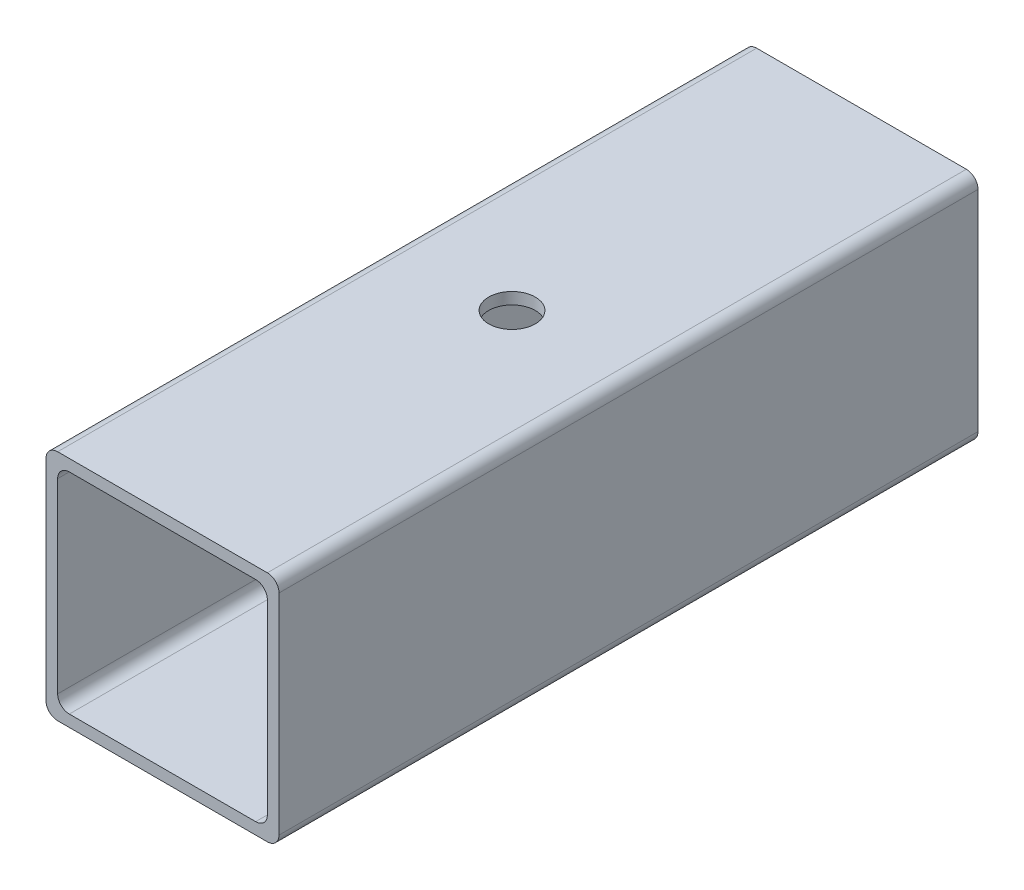
ISO-10303-21;
HEADER;
FILE_DESCRIPTION(('STEP AP214'),'2;1');
FILE_NAME('part.step','',(''),(''),'','','');
FILE_SCHEMA(('AUTOMOTIVE_DESIGN { 1 0 10303 214 1 1 1 1 }'));
ENDSEC;
DATA;
#1=APPLICATION_CONTEXT('core data for automotive mechanical design processes');
#2=APPLICATION_PROTOCOL_DEFINITION('international standard','automotive_design',2000,#1);
#3=PRODUCT_CONTEXT('',#1,'mechanical');
#4=PRODUCT('Part','Part','',(#3));
#5=PRODUCT_RELATED_PRODUCT_CATEGORY('part','',(#4));
#6=PRODUCT_DEFINITION_FORMATION('','',#4);
#7=PRODUCT_DEFINITION_CONTEXT('part definition',#1,'design');
#8=PRODUCT_DEFINITION('design','',#6,#7);
#9=PRODUCT_DEFINITION_SHAPE('','',#8);
#10=(LENGTH_UNIT() NAMED_UNIT(*) SI_UNIT(.MILLI.,.METRE.));
#11=(NAMED_UNIT(*) PLANE_ANGLE_UNIT() SI_UNIT($,.RADIAN.));
#12=(NAMED_UNIT(*) SI_UNIT($,.STERADIAN.) SOLID_ANGLE_UNIT());
#13=UNCERTAINTY_MEASURE_WITH_UNIT(LENGTH_MEASURE(1.E-05),#10,'distance_accuracy_value','');
#14=(GEOMETRIC_REPRESENTATION_CONTEXT(3) GLOBAL_UNCERTAINTY_ASSIGNED_CONTEXT((#13)) GLOBAL_UNIT_ASSIGNED_CONTEXT((#10,
#11,#12)) REPRESENTATION_CONTEXT('',''));
#15=CARTESIAN_POINT('',(0.,0.,0.));
#16=DIRECTION('',(0.,0.,1.));
#17=DIRECTION('',(1.,0.,0.));
#18=AXIS2_PLACEMENT_3D('',#15,#16,#17);
#19=CARTESIAN_POINT('',(0.,0.,180.));
#20=DIRECTION('',(0.,0.,1.));
#21=DIRECTION('',(1.,0.,0.));
#22=AXIS2_PLACEMENT_3D('',#19,#20,#21);
#23=PLANE('',#22);
#24=DIRECTION('',(1.,0.,0.));
#25=VECTOR('',#24,1.);
#26=CARTESIAN_POINT('',(-30.,-30.,180.));
#27=LINE('',#26,#25);
#28=CARTESIAN_POINT('',(-27.,-30.,180.));
#29=VERTEX_POINT('',#28);
#30=CARTESIAN_POINT('',(27.,-30.,180.));
#31=VERTEX_POINT('',#30);
#32=EDGE_CURVE('E180',#29,#31,#27,.T.);
#33=ORIENTED_EDGE('',*,*,#32,.T.);
#34=CARTESIAN_POINT('',(27.,-27.,180.));
#35=DIRECTION('',(0.,0.,1.));
#36=DIRECTION('',(1.,0.,0.));
#37=AXIS2_PLACEMENT_3D('',#34,#35,#36);
#38=CIRCLE('',#37,3.);
#39=CARTESIAN_POINT('',(30.,-27.,180.));
#40=VERTEX_POINT('',#39);
#41=EDGE_CURVE('E247',#31,#40,#38,.T.);
#42=ORIENTED_EDGE('',*,*,#41,.T.);
#43=DIRECTION('',(0.,1.,0.));
#44=VECTOR('',#43,1.);
#45=CARTESIAN_POINT('',(30.,30.,180.));
#46=LINE('',#45,#44);
#47=CARTESIAN_POINT('',(30.,27.,180.));
#48=VERTEX_POINT('',#47);
#49=EDGE_CURVE('E313',#40,#48,#46,.T.);
#50=ORIENTED_EDGE('',*,*,#49,.T.);
#51=CARTESIAN_POINT('',(27.,27.,180.));
#52=DIRECTION('',(0.,0.,1.));
#53=DIRECTION('',(1.,0.,0.));
#54=AXIS2_PLACEMENT_3D('',#51,#52,#53);
#55=CIRCLE('',#54,3.);
#56=CARTESIAN_POINT('',(27.,30.,180.));
#57=VERTEX_POINT('',#56);
#58=EDGE_CURVE('E239',#48,#57,#55,.T.);
#59=ORIENTED_EDGE('',*,*,#58,.T.);
#60=DIRECTION('',(-1.,0.,0.));
#61=VECTOR('',#60,1.);
#62=CARTESIAN_POINT('',(-30.,30.,180.));
#63=LINE('',#62,#61);
#64=CARTESIAN_POINT('',(-27.,30.,180.));
#65=VERTEX_POINT('',#64);
#66=EDGE_CURVE('E317',#57,#65,#63,.T.);
#67=ORIENTED_EDGE('',*,*,#66,.T.);
#68=CARTESIAN_POINT('',(-27.,27.,180.));
#69=DIRECTION('',(0.,0.,1.));
#70=DIRECTION('',(1.,0.,0.));
#71=AXIS2_PLACEMENT_3D('',#68,#69,#70);
#72=CIRCLE('',#71,3.);
#73=CARTESIAN_POINT('',(-30.,27.,180.));
#74=VERTEX_POINT('',#73);
#75=EDGE_CURVE('E61',#65,#74,#72,.T.);
#76=ORIENTED_EDGE('',*,*,#75,.T.);
#77=DIRECTION('',(0.,-1.,0.));
#78=VECTOR('',#77,1.);
#79=CARTESIAN_POINT('',(-30.,30.,180.));
#80=LINE('',#79,#78);
#81=CARTESIAN_POINT('',(-30.,-27.,180.));
#82=VERTEX_POINT('',#81);
#83=EDGE_CURVE('E188',#74,#82,#80,.T.);
#84=ORIENTED_EDGE('',*,*,#83,.T.);
#85=CARTESIAN_POINT('',(-27.,-27.,180.));
#86=DIRECTION('',(0.,0.,1.));
#87=DIRECTION('',(1.,0.,0.));
#88=AXIS2_PLACEMENT_3D('',#85,#86,#87);
#89=CIRCLE('',#88,3.);
#90=EDGE_CURVE('E244',#82,#29,#89,.T.);
#91=ORIENTED_EDGE('',*,*,#90,.T.);
#92=EDGE_LOOP('',(#33,#42,#50,#59,#67,#76,#84,#91));
#93=FACE_BOUND('',#92,.T.);
#94=DIRECTION('',(-1.,0.,0.));
#95=VECTOR('',#94,1.);
#96=CARTESIAN_POINT('',(-27.,27.,180.));
#97=LINE('',#96,#95);
#98=CARTESIAN_POINT('',(24.,27.,180.));
#99=VERTEX_POINT('',#98);
#100=CARTESIAN_POINT('',(-24.,27.,180.));
#101=VERTEX_POINT('',#100);
#102=EDGE_CURVE('E288',#99,#101,#97,.T.);
#103=ORIENTED_EDGE('',*,*,#102,.F.);
#104=CARTESIAN_POINT('',(24.,24.,180.));
#105=DIRECTION('',(0.,0.,1.));
#106=DIRECTION('',(1.,0.,0.));
#107=AXIS2_PLACEMENT_3D('',#104,#105,#106);
#108=CIRCLE('',#107,3.);
#109=CARTESIAN_POINT('',(27.,24.,180.));
#110=VERTEX_POINT('',#109);
#111=EDGE_CURVE('E164',#99,#110,#108,.F.);
#112=ORIENTED_EDGE('',*,*,#111,.T.);
#113=DIRECTION('',(0.,1.,0.));
#114=VECTOR('',#113,1.);
#115=CARTESIAN_POINT('',(27.,27.,180.));
#116=LINE('',#115,#114);
#117=CARTESIAN_POINT('',(27.,-24.,180.));
#118=VERTEX_POINT('',#117);
#119=EDGE_CURVE('E285',#118,#110,#116,.T.);
#120=ORIENTED_EDGE('',*,*,#119,.F.);
#121=CARTESIAN_POINT('',(24.,-24.,180.));
#122=DIRECTION('',(0.,0.,1.));
#123=DIRECTION('',(1.,0.,0.));
#124=AXIS2_PLACEMENT_3D('',#121,#122,#123);
#125=CIRCLE('',#124,3.);
#126=CARTESIAN_POINT('',(24.,-27.,180.));
#127=VERTEX_POINT('',#126);
#128=EDGE_CURVE('E272',#118,#127,#125,.F.);
#129=ORIENTED_EDGE('',*,*,#128,.T.);
#130=DIRECTION('',(1.,0.,0.));
#131=VECTOR('',#130,1.);
#132=CARTESIAN_POINT('',(-27.,-27.,180.));
#133=LINE('',#132,#131);
#134=CARTESIAN_POINT('',(-24.,-27.,180.));
#135=VERTEX_POINT('',#134);
#136=EDGE_CURVE('E327',#135,#127,#133,.T.);
#137=ORIENTED_EDGE('',*,*,#136,.F.);
#138=CARTESIAN_POINT('',(-24.,-24.,180.));
#139=DIRECTION('',(0.,0.,1.));
#140=DIRECTION('',(1.,0.,0.));
#141=AXIS2_PLACEMENT_3D('',#138,#139,#140);
#142=CIRCLE('',#141,3.);
#143=CARTESIAN_POINT('',(-27.,-24.,180.));
#144=VERTEX_POINT('',#143);
#145=EDGE_CURVE('E266',#135,#144,#142,.F.);
#146=ORIENTED_EDGE('',*,*,#145,.T.);
#147=DIRECTION('',(0.,-1.,0.));
#148=VECTOR('',#147,1.);
#149=CARTESIAN_POINT('',(-27.,27.,180.));
#150=LINE('',#149,#148);
#151=CARTESIAN_POINT('',(-27.,24.,180.));
#152=VERTEX_POINT('',#151);
#153=EDGE_CURVE('E478',#152,#144,#150,.T.);
#154=ORIENTED_EDGE('',*,*,#153,.F.);
#155=CARTESIAN_POINT('',(-24.,24.,180.));
#156=DIRECTION('',(0.,0.,1.));
#157=DIRECTION('',(1.,0.,0.));
#158=AXIS2_PLACEMENT_3D('',#155,#156,#157);
#159=CIRCLE('',#158,3.);
#160=EDGE_CURVE('E11',#152,#101,#159,.F.);
#161=ORIENTED_EDGE('',*,*,#160,.T.);
#162=EDGE_LOOP('',(#103,#112,#120,#129,#137,#146,#154,#161));
#163=FACE_BOUND('',#162,.T.);
#164=ADVANCED_FACE('F37',(#93,#163),#23,.T.);
#165=CARTESIAN_POINT('',(0.,0.,0.));
#166=DIRECTION('',(0.,0.,1.));
#167=DIRECTION('',(1.,0.,0.));
#168=AXIS2_PLACEMENT_3D('',#165,#166,#167);
#169=PLANE('',#168);
#170=DIRECTION('',(0.,1.,0.));
#171=VECTOR('',#170,1.);
#172=CARTESIAN_POINT('',(30.,30.,0.));
#173=LINE('',#172,#171);
#174=CARTESIAN_POINT('',(30.,-27.,0.));
#175=VERTEX_POINT('',#174);
#176=CARTESIAN_POINT('',(30.,27.,0.));
#177=VERTEX_POINT('',#176);
#178=EDGE_CURVE('E322',#175,#177,#173,.T.);
#179=ORIENTED_EDGE('',*,*,#178,.F.);
#180=CARTESIAN_POINT('',(27.,-27.,0.));
#181=DIRECTION('',(0.,0.,1.));
#182=DIRECTION('',(1.,0.,0.));
#183=AXIS2_PLACEMENT_3D('',#180,#181,#182);
#184=CIRCLE('',#183,3.);
#185=CARTESIAN_POINT('',(27.,-30.,0.));
#186=VERTEX_POINT('',#185);
#187=EDGE_CURVE('E229',#175,#186,#184,.F.);
#188=ORIENTED_EDGE('',*,*,#187,.T.);
#189=DIRECTION('',(1.,0.,0.));
#190=VECTOR('',#189,1.);
#191=CARTESIAN_POINT('',(-30.,-30.,0.));
#192=LINE('',#191,#190);
#193=CARTESIAN_POINT('',(-27.,-30.,0.));
#194=VERTEX_POINT('',#193);
#195=EDGE_CURVE('E191',#194,#186,#192,.T.);
#196=ORIENTED_EDGE('',*,*,#195,.F.);
#197=CARTESIAN_POINT('',(-27.,-27.,0.));
#198=DIRECTION('',(0.,0.,1.));
#199=DIRECTION('',(1.,0.,0.));
#200=AXIS2_PLACEMENT_3D('',#197,#198,#199);
#201=CIRCLE('',#200,3.);
#202=CARTESIAN_POINT('',(-30.,-27.,0.));
#203=VERTEX_POINT('',#202);
#204=EDGE_CURVE('E226',#194,#203,#201,.F.);
#205=ORIENTED_EDGE('',*,*,#204,.T.);
#206=DIRECTION('',(0.,-1.,0.));
#207=VECTOR('',#206,1.);
#208=CARTESIAN_POINT('',(-30.,30.0000000000001,0.));
#209=LINE('',#208,#207);
#210=CARTESIAN_POINT('',(-30.,27.0000000000001,0.));
#211=VERTEX_POINT('',#210);
#212=EDGE_CURVE('E330',#211,#203,#209,.T.);
#213=ORIENTED_EDGE('',*,*,#212,.F.);
#214=CARTESIAN_POINT('',(-27.,27.,0.));
#215=DIRECTION('',(0.,0.,1.));
#216=DIRECTION('',(1.,0.,0.));
#217=AXIS2_PLACEMENT_3D('',#214,#215,#216);
#218=CIRCLE('',#217,3.);
#219=CARTESIAN_POINT('',(-27.,30.,0.));
#220=VERTEX_POINT('',#219);
#221=EDGE_CURVE('E223',#211,#220,#218,.F.);
#222=ORIENTED_EDGE('',*,*,#221,.T.);
#223=DIRECTION('',(-1.,0.,0.));
#224=VECTOR('',#223,1.);
#225=CARTESIAN_POINT('',(-30.,30.0000000000001,0.));
#226=LINE('',#225,#224);
#227=CARTESIAN_POINT('',(27.,30.,0.));
#228=VERTEX_POINT('',#227);
#229=EDGE_CURVE('E326',#228,#220,#226,.T.);
#230=ORIENTED_EDGE('',*,*,#229,.F.);
#231=CARTESIAN_POINT('',(27.,27.,0.));
#232=DIRECTION('',(0.,0.,1.));
#233=DIRECTION('',(1.,0.,0.));
#234=AXIS2_PLACEMENT_3D('',#231,#232,#233);
#235=CIRCLE('',#234,3.);
#236=EDGE_CURVE('E220',#228,#177,#235,.F.);
#237=ORIENTED_EDGE('',*,*,#236,.T.);
#238=EDGE_LOOP('',(#179,#188,#196,#205,#213,#222,#230,#237));
#239=FACE_BOUND('',#238,.T.);
#240=DIRECTION('',(1.,0.,0.));
#241=VECTOR('',#240,1.);
#242=CARTESIAN_POINT('',(-27.,-27.,0.));
#243=LINE('',#242,#241);
#244=CARTESIAN_POINT('',(-24.,-27.,0.));
#245=VERTEX_POINT('',#244);
#246=CARTESIAN_POINT('',(24.,-27.,0.));
#247=VERTEX_POINT('',#246);
#248=EDGE_CURVE('E175',#245,#247,#243,.T.);
#249=ORIENTED_EDGE('',*,*,#248,.T.);
#250=CARTESIAN_POINT('',(24.,-24.,0.));
#251=DIRECTION('',(0.,0.,1.));
#252=DIRECTION('',(1.,0.,0.));
#253=AXIS2_PLACEMENT_3D('',#250,#251,#252);
#254=CIRCLE('',#253,3.);
#255=CARTESIAN_POINT('',(27.,-24.,0.));
#256=VERTEX_POINT('',#255);
#257=EDGE_CURVE('E269',#247,#256,#254,.T.);
#258=ORIENTED_EDGE('',*,*,#257,.T.);
#259=DIRECTION('',(0.,1.,0.));
#260=VECTOR('',#259,1.);
#261=CARTESIAN_POINT('',(27.,27.,0.));
#262=LINE('',#261,#260);
#263=CARTESIAN_POINT('',(27.,24.,0.));
#264=VERTEX_POINT('',#263);
#265=EDGE_CURVE('E300',#256,#264,#262,.T.);
#266=ORIENTED_EDGE('',*,*,#265,.T.);
#267=CARTESIAN_POINT('',(24.,24.,0.));
#268=DIRECTION('',(0.,0.,1.));
#269=DIRECTION('',(1.,0.,0.));
#270=AXIS2_PLACEMENT_3D('',#267,#268,#269);
#271=CIRCLE('',#270,3.);
#272=CARTESIAN_POINT('',(24.,27.,0.));
#273=VERTEX_POINT('',#272);
#274=EDGE_CURVE('E275',#264,#273,#271,.T.);
#275=ORIENTED_EDGE('',*,*,#274,.T.);
#276=DIRECTION('',(-1.,0.,0.));
#277=VECTOR('',#276,1.);
#278=CARTESIAN_POINT('',(-27.,27.,0.));
#279=LINE('',#278,#277);
#280=CARTESIAN_POINT('',(-24.,27.,0.));
#281=VERTEX_POINT('',#280);
#282=EDGE_CURVE('E158',#273,#281,#279,.T.);
#283=ORIENTED_EDGE('',*,*,#282,.T.);
#284=CARTESIAN_POINT('',(-24.,24.,0.));
#285=DIRECTION('',(0.,0.,1.));
#286=DIRECTION('',(1.,0.,0.));
#287=AXIS2_PLACEMENT_3D('',#284,#285,#286);
#288=CIRCLE('',#287,3.);
#289=CARTESIAN_POINT('',(-27.,24.,0.));
#290=VERTEX_POINT('',#289);
#291=EDGE_CURVE('E47',#281,#290,#288,.T.);
#292=ORIENTED_EDGE('',*,*,#291,.T.);
#293=DIRECTION('',(0.,-1.,0.));
#294=VECTOR('',#293,1.);
#295=CARTESIAN_POINT('',(-27.,27.,0.));
#296=LINE('',#295,#294);
#297=CARTESIAN_POINT('',(-27.,-24.,0.));
#298=VERTEX_POINT('',#297);
#299=EDGE_CURVE('E156',#290,#298,#296,.T.);
#300=ORIENTED_EDGE('',*,*,#299,.T.);
#301=CARTESIAN_POINT('',(-24.,-24.,0.));
#302=DIRECTION('',(0.,0.,1.));
#303=DIRECTION('',(1.,0.,0.));
#304=AXIS2_PLACEMENT_3D('',#301,#302,#303);
#305=CIRCLE('',#304,3.);
#306=EDGE_CURVE('E263',#298,#245,#305,.T.);
#307=ORIENTED_EDGE('',*,*,#306,.T.);
#308=EDGE_LOOP('',(#249,#258,#266,#275,#283,#292,#300,#307));
#309=FACE_BOUND('',#308,.T.);
#310=ADVANCED_FACE('F155',(#239,#309),#169,.F.);
#311=CARTESIAN_POINT('',(30.,30.,180.));
#312=DIRECTION('',(-1.,0.,0.));
#313=DIRECTION('',(0.,-1.,0.));
#314=AXIS2_PLACEMENT_3D('',#311,#312,#313);
#315=PLANE('',#314);
#316=ORIENTED_EDGE('',*,*,#49,.F.);
#317=DIRECTION('',(0.,0.,-1.));
#318=VECTOR('',#317,1.);
#319=CARTESIAN_POINT('',(30.,-27.,180.));
#320=LINE('',#319,#318);
#321=EDGE_CURVE('E216',#40,#175,#320,.T.);
#322=ORIENTED_EDGE('',*,*,#321,.T.);
#323=ORIENTED_EDGE('',*,*,#178,.T.);
#324=DIRECTION('',(0.,0.,-1.));
#325=VECTOR('',#324,1.);
#326=CARTESIAN_POINT('',(30.,27.,180.));
#327=LINE('',#326,#325);
#328=EDGE_CURVE('E213',#177,#48,#327,.F.);
#329=ORIENTED_EDGE('',*,*,#328,.T.);
#330=EDGE_LOOP('',(#316,#322,#323,#329));
#331=FACE_BOUND('',#330,.T.);
#332=ADVANCED_FACE('F351',(#331),#315,.F.);
#333=CARTESIAN_POINT('',(-30.,30.,180.));
#334=DIRECTION('',(0.,-1.,0.));
#335=DIRECTION('',(0.,0.,-1.));
#336=AXIS2_PLACEMENT_3D('',#333,#334,#335);
#337=PLANE('',#336);
#338=CARTESIAN_POINT('',(0.,30.,89.9999999999999));
#339=DIRECTION('',(0.,1.,0.));
#340=DIRECTION('',(0.,0.,1.));
#341=AXIS2_PLACEMENT_3D('',#338,#339,#340);
#342=CIRCLE('',#341,6.);
#343=CARTESIAN_POINT('',(0.,30.,95.9999999999999));
#344=VERTEX_POINT('',#343);
#345=EDGE_CURVE('E498',#344,#344,#342,.T.);
#346=ORIENTED_EDGE('',*,*,#345,.F.);
#347=EDGE_LOOP('',(#346));
#348=FACE_BOUND('',#347,.T.);
#349=ORIENTED_EDGE('',*,*,#229,.T.);
#350=DIRECTION('',(0.,0.,-1.));
#351=VECTOR('',#350,1.);
#352=CARTESIAN_POINT('',(-27.,30.,180.));
#353=LINE('',#352,#351);
#354=EDGE_CURVE('E260',#220,#65,#353,.F.);
#355=ORIENTED_EDGE('',*,*,#354,.T.);
#356=ORIENTED_EDGE('',*,*,#66,.F.);
#357=DIRECTION('',(0.,0.,-1.));
#358=VECTOR('',#357,1.);
#359=CARTESIAN_POINT('',(27.,30.,180.));
#360=LINE('',#359,#358);
#361=EDGE_CURVE('E256',#57,#228,#360,.T.);
#362=ORIENTED_EDGE('',*,*,#361,.T.);
#363=EDGE_LOOP('',(#349,#355,#356,#362));
#364=FACE_BOUND('',#363,.T.);
#365=ADVANCED_FACE('F358',(#348,#364),#337,.F.);
#366=CARTESIAN_POINT('',(-30.,30.,180.));
#367=DIRECTION('',(1.,0.,0.));
#368=DIRECTION('',(0.,1.,0.));
#369=AXIS2_PLACEMENT_3D('',#366,#367,#368);
#370=PLANE('',#369);
#371=ORIENTED_EDGE('',*,*,#212,.T.);
#372=DIRECTION('',(0.,0.,-1.));
#373=VECTOR('',#372,1.);
#374=CARTESIAN_POINT('',(-30.,-27.,180.));
#375=LINE('',#374,#373);
#376=EDGE_CURVE('E54',#203,#82,#375,.F.);
#377=ORIENTED_EDGE('',*,*,#376,.T.);
#378=ORIENTED_EDGE('',*,*,#83,.F.);
#379=DIRECTION('',(0.,0.,-1.));
#380=VECTOR('',#379,1.);
#381=CARTESIAN_POINT('',(-30.,27.,180.));
#382=LINE('',#381,#380);
#383=EDGE_CURVE('E250',#74,#211,#382,.T.);
#384=ORIENTED_EDGE('',*,*,#383,.T.);
#385=EDGE_LOOP('',(#371,#377,#378,#384));
#386=FACE_BOUND('',#385,.T.);
#387=ADVANCED_FACE('F364',(#386),#370,.F.);
#388=CARTESIAN_POINT('',(-30.,-30.,180.));
#389=DIRECTION('',(0.,1.,0.));
#390=DIRECTION('',(0.,0.,1.));
#391=AXIS2_PLACEMENT_3D('',#388,#389,#390);
#392=PLANE('',#391);
#393=CARTESIAN_POINT('',(0.,-30.,90.));
#394=DIRECTION('',(0.,1.,0.));
#395=DIRECTION('',(0.,0.,1.));
#396=AXIS2_PLACEMENT_3D('',#393,#394,#395);
#397=CIRCLE('',#396,6.);
#398=CARTESIAN_POINT('',(0.,-30.,96.));
#399=VERTEX_POINT('',#398);
#400=EDGE_CURVE('E472',#399,#399,#397,.T.);
#401=ORIENTED_EDGE('',*,*,#400,.T.);
#402=EDGE_LOOP('',(#401));
#403=FACE_BOUND('',#402,.T.);
#404=ORIENTED_EDGE('',*,*,#195,.T.);
#405=DIRECTION('',(0.,0.,-1.));
#406=VECTOR('',#405,1.);
#407=CARTESIAN_POINT('',(27.,-30.,180.));
#408=LINE('',#407,#406);
#409=EDGE_CURVE('E236',#186,#31,#408,.F.);
#410=ORIENTED_EDGE('',*,*,#409,.T.);
#411=ORIENTED_EDGE('',*,*,#32,.F.);
#412=DIRECTION('',(0.,0.,-1.));
#413=VECTOR('',#412,1.);
#414=CARTESIAN_POINT('',(-27.,-30.,180.));
#415=LINE('',#414,#413);
#416=EDGE_CURVE('E232',#29,#194,#415,.T.);
#417=ORIENTED_EDGE('',*,*,#416,.T.);
#418=EDGE_LOOP('',(#404,#410,#411,#417));
#419=FACE_BOUND('',#418,.T.);
#420=ADVANCED_FACE('F340',(#403,#419),#392,.F.);
#421=CARTESIAN_POINT('',(27.,27.,180.));
#422=DIRECTION('',(-1.,0.,0.));
#423=DIRECTION('',(0.,-1.,0.));
#424=AXIS2_PLACEMENT_3D('',#421,#422,#423);
#425=PLANE('',#424);
#426=ORIENTED_EDGE('',*,*,#265,.F.);
#427=DIRECTION('',(0.,0.,-1.));
#428=VECTOR('',#427,1.);
#429=CARTESIAN_POINT('',(27.,-24.,180.));
#430=LINE('',#429,#428);
#431=EDGE_CURVE('E204',#256,#118,#430,.F.);
#432=ORIENTED_EDGE('',*,*,#431,.T.);
#433=ORIENTED_EDGE('',*,*,#119,.T.);
#434=DIRECTION('',(0.,0.,-1.));
#435=VECTOR('',#434,1.);
#436=CARTESIAN_POINT('',(27.,24.,0.));
#437=LINE('',#436,#435);
#438=EDGE_CURVE('E200',#110,#264,#437,.T.);
#439=ORIENTED_EDGE('',*,*,#438,.T.);
#440=EDGE_LOOP('',(#426,#432,#433,#439));
#441=FACE_BOUND('',#440,.T.);
#442=ADVANCED_FACE('F294',(#441),#425,.T.);
#443=CARTESIAN_POINT('',(-27.,27.,180.));
#444=DIRECTION('',(0.,-1.,0.));
#445=DIRECTION('',(0.,0.,-1.));
#446=AXIS2_PLACEMENT_3D('',#443,#444,#445);
#447=PLANE('',#446);
#448=CARTESIAN_POINT('',(0.,27.,89.9999999999999));
#449=DIRECTION('',(0.,-1.,0.));
#450=DIRECTION('',(0.,0.,-1.));
#451=AXIS2_PLACEMENT_3D('',#448,#449,#450);
#452=CIRCLE('',#451,6.);
#453=CARTESIAN_POINT('',(0.,27.,83.9999999999999));
#454=VERTEX_POINT('',#453);
#455=EDGE_CURVE('E307',#454,#454,#452,.T.);
#456=ORIENTED_EDGE('',*,*,#455,.F.);
#457=EDGE_LOOP('',(#456));
#458=FACE_BOUND('',#457,.T.);
#459=ORIENTED_EDGE('',*,*,#282,.F.);
#460=DIRECTION('',(0.,0.,-1.));
#461=VECTOR('',#460,1.);
#462=CARTESIAN_POINT('',(24.,27.,180.));
#463=LINE('',#462,#461);
#464=EDGE_CURVE('E210',#273,#99,#463,.F.);
#465=ORIENTED_EDGE('',*,*,#464,.T.);
#466=ORIENTED_EDGE('',*,*,#102,.T.);
#467=DIRECTION('',(0.,0.,-1.));
#468=VECTOR('',#467,1.);
#469=CARTESIAN_POINT('',(-24.,27.,0.));
#470=LINE('',#469,#468);
#471=EDGE_CURVE('E207',#101,#281,#470,.T.);
#472=ORIENTED_EDGE('',*,*,#471,.T.);
#473=EDGE_LOOP('',(#459,#465,#466,#472));
#474=FACE_BOUND('',#473,.T.);
#475=ADVANCED_FACE('F302',(#458,#474),#447,.T.);
#476=CARTESIAN_POINT('',(-27.,27.,180.));
#477=DIRECTION('',(1.,0.,0.));
#478=DIRECTION('',(0.,1.,0.));
#479=AXIS2_PLACEMENT_3D('',#476,#477,#478);
#480=PLANE('',#479);
#481=ORIENTED_EDGE('',*,*,#153,.T.);
#482=DIRECTION('',(0.,0.,-1.));
#483=VECTOR('',#482,1.);
#484=CARTESIAN_POINT('',(-27.,-24.,0.));
#485=LINE('',#484,#483);
#486=EDGE_CURVE('E173',#144,#298,#485,.T.);
#487=ORIENTED_EDGE('',*,*,#486,.T.);
#488=ORIENTED_EDGE('',*,*,#299,.F.);
#489=DIRECTION('',(0.,0.,-1.));
#490=VECTOR('',#489,1.);
#491=CARTESIAN_POINT('',(-27.,24.,180.));
#492=LINE('',#491,#490);
#493=EDGE_CURVE('E170',#290,#152,#492,.F.);
#494=ORIENTED_EDGE('',*,*,#493,.T.);
#495=EDGE_LOOP('',(#481,#487,#488,#494));
#496=FACE_BOUND('',#495,.T.);
#497=ADVANCED_FACE('F169',(#496),#480,.T.);
#498=CARTESIAN_POINT('',(-27.,-27.,180.));
#499=DIRECTION('',(0.,1.,0.));
#500=DIRECTION('',(0.,0.,1.));
#501=AXIS2_PLACEMENT_3D('',#498,#499,#500);
#502=PLANE('',#501);
#503=CARTESIAN_POINT('',(0.,-27.,90.));
#504=DIRECTION('',(0.,1.,0.));
#505=DIRECTION('',(0.,0.,1.));
#506=AXIS2_PLACEMENT_3D('',#503,#504,#505);
#507=CIRCLE('',#506,6.);
#508=CARTESIAN_POINT('',(0.,-27.,96.));
#509=VERTEX_POINT('',#508);
#510=EDGE_CURVE('E41',#509,#509,#507,.T.);
#511=ORIENTED_EDGE('',*,*,#510,.F.);
#512=EDGE_LOOP('',(#511));
#513=FACE_BOUND('',#512,.T.);
#514=ORIENTED_EDGE('',*,*,#248,.F.);
#515=DIRECTION('',(0.,0.,-1.));
#516=VECTOR('',#515,1.);
#517=CARTESIAN_POINT('',(-24.,-27.,180.));
#518=LINE('',#517,#516);
#519=EDGE_CURVE('E197',#245,#135,#518,.F.);
#520=ORIENTED_EDGE('',*,*,#519,.T.);
#521=ORIENTED_EDGE('',*,*,#136,.T.);
#522=DIRECTION('',(0.,0.,-1.));
#523=VECTOR('',#522,1.);
#524=CARTESIAN_POINT('',(24.,-27.,0.));
#525=LINE('',#524,#523);
#526=EDGE_CURVE('E185',#127,#247,#525,.T.);
#527=ORIENTED_EDGE('',*,*,#526,.T.);
#528=EDGE_LOOP('',(#514,#520,#521,#527));
#529=FACE_BOUND('',#528,.T.);
#530=ADVANCED_FACE('F398',(#513,#529),#502,.T.);
#531=CARTESIAN_POINT('',(-24.,-24.,180.));
#532=DIRECTION('',(0.,0.,1.));
#533=DIRECTION('',(1.,0.,0.));
#534=AXIS2_PLACEMENT_3D('',#531,#532,#533);
#535=CYLINDRICAL_SURFACE('',#534,3.);
#536=ORIENTED_EDGE('',*,*,#145,.F.);
#537=ORIENTED_EDGE('',*,*,#519,.F.);
#538=ORIENTED_EDGE('',*,*,#306,.F.);
#539=ORIENTED_EDGE('',*,*,#486,.F.);
#540=EDGE_LOOP('',(#536,#537,#538,#539));
#541=FACE_BOUND('',#540,.T.);
#542=ADVANCED_FACE('F394',(#541),#535,.F.);
#543=CARTESIAN_POINT('',(24.,-24.,180.));
#544=DIRECTION('',(0.,0.,1.));
#545=DIRECTION('',(1.,0.,0.));
#546=AXIS2_PLACEMENT_3D('',#543,#544,#545);
#547=CYLINDRICAL_SURFACE('',#546,3.);
#548=ORIENTED_EDGE('',*,*,#128,.F.);
#549=ORIENTED_EDGE('',*,*,#431,.F.);
#550=ORIENTED_EDGE('',*,*,#257,.F.);
#551=ORIENTED_EDGE('',*,*,#526,.F.);
#552=EDGE_LOOP('',(#548,#549,#550,#551));
#553=FACE_BOUND('',#552,.T.);
#554=ADVANCED_FACE('F397',(#553),#547,.F.);
#555=CARTESIAN_POINT('',(24.,24.,180.));
#556=DIRECTION('',(0.,0.,1.));
#557=DIRECTION('',(1.,0.,0.));
#558=AXIS2_PLACEMENT_3D('',#555,#556,#557);
#559=CYLINDRICAL_SURFACE('',#558,3.);
#560=ORIENTED_EDGE('',*,*,#111,.F.);
#561=ORIENTED_EDGE('',*,*,#464,.F.);
#562=ORIENTED_EDGE('',*,*,#274,.F.);
#563=ORIENTED_EDGE('',*,*,#438,.F.);
#564=EDGE_LOOP('',(#560,#561,#562,#563));
#565=FACE_BOUND('',#564,.T.);
#566=ADVANCED_FACE('F299',(#565),#559,.F.);
#567=CARTESIAN_POINT('',(-24.,24.,180.));
#568=DIRECTION('',(0.,0.,1.));
#569=DIRECTION('',(1.,0.,0.));
#570=AXIS2_PLACEMENT_3D('',#567,#568,#569);
#571=CYLINDRICAL_SURFACE('',#570,3.);
#572=ORIENTED_EDGE('',*,*,#160,.F.);
#573=ORIENTED_EDGE('',*,*,#493,.F.);
#574=ORIENTED_EDGE('',*,*,#291,.F.);
#575=ORIENTED_EDGE('',*,*,#471,.F.);
#576=EDGE_LOOP('',(#572,#573,#574,#575));
#577=FACE_BOUND('',#576,.T.);
#578=ADVANCED_FACE('F178',(#577),#571,.F.);
#579=CARTESIAN_POINT('',(27.,-27.,180.));
#580=DIRECTION('',(0.,0.,-1.));
#581=DIRECTION('',(-1.,0.,0.));
#582=AXIS2_PLACEMENT_3D('',#579,#580,#581);
#583=CYLINDRICAL_SURFACE('',#582,3.);
#584=ORIENTED_EDGE('',*,*,#41,.F.);
#585=ORIENTED_EDGE('',*,*,#409,.F.);
#586=ORIENTED_EDGE('',*,*,#187,.F.);
#587=ORIENTED_EDGE('',*,*,#321,.F.);
#588=EDGE_LOOP('',(#584,#585,#586,#587));
#589=FACE_BOUND('',#588,.T.);
#590=ADVANCED_FACE('F346',(#589),#583,.T.);
#591=CARTESIAN_POINT('',(-27.,-27.,180.));
#592=DIRECTION('',(0.,0.,-1.));
#593=DIRECTION('',(-1.,0.,0.));
#594=AXIS2_PLACEMENT_3D('',#591,#592,#593);
#595=CYLINDRICAL_SURFACE('',#594,3.);
#596=ORIENTED_EDGE('',*,*,#90,.F.);
#597=ORIENTED_EDGE('',*,*,#376,.F.);
#598=ORIENTED_EDGE('',*,*,#204,.F.);
#599=ORIENTED_EDGE('',*,*,#416,.F.);
#600=EDGE_LOOP('',(#596,#597,#598,#599));
#601=FACE_BOUND('',#600,.T.);
#602=ADVANCED_FACE('F367',(#601),#595,.T.);
#603=CARTESIAN_POINT('',(-27.,27.,180.));
#604=DIRECTION('',(0.,0.,-1.));
#605=DIRECTION('',(-1.,0.,0.));
#606=AXIS2_PLACEMENT_3D('',#603,#604,#605);
#607=CYLINDRICAL_SURFACE('',#606,3.);
#608=ORIENTED_EDGE('',*,*,#75,.F.);
#609=ORIENTED_EDGE('',*,*,#354,.F.);
#610=ORIENTED_EDGE('',*,*,#221,.F.);
#611=ORIENTED_EDGE('',*,*,#383,.F.);
#612=EDGE_LOOP('',(#608,#609,#610,#611));
#613=FACE_BOUND('',#612,.T.);
#614=ADVANCED_FACE('F362',(#613),#607,.T.);
#615=CARTESIAN_POINT('',(27.,27.,180.));
#616=DIRECTION('',(0.,0.,-1.));
#617=DIRECTION('',(-1.,0.,0.));
#618=AXIS2_PLACEMENT_3D('',#615,#616,#617);
#619=CYLINDRICAL_SURFACE('',#618,3.);
#620=ORIENTED_EDGE('',*,*,#58,.F.);
#621=ORIENTED_EDGE('',*,*,#328,.F.);
#622=ORIENTED_EDGE('',*,*,#236,.F.);
#623=ORIENTED_EDGE('',*,*,#361,.F.);
#624=EDGE_LOOP('',(#620,#621,#622,#623));
#625=FACE_BOUND('',#624,.T.);
#626=ADVANCED_FACE('F39',(#625),#619,.T.);
#627=CARTESIAN_POINT('',(0.,-30.,90.));
#628=DIRECTION('',(0.,1.,0.));
#629=DIRECTION('',(0.,0.,1.));
#630=AXIS2_PLACEMENT_3D('',#627,#628,#629);
#631=CYLINDRICAL_SURFACE('',#630,6.);
#632=ORIENTED_EDGE('',*,*,#510,.T.);
#633=EDGE_LOOP('',(#632));
#634=FACE_BOUND('',#633,.T.);
#635=ORIENTED_EDGE('',*,*,#400,.F.);
#636=EDGE_LOOP('',(#635));
#637=FACE_BOUND('',#636,.T.);
#638=ADVANCED_FACE('F433',(#634,#637),#631,.F.);
#639=ORIENTED_EDGE('',*,*,#455,.T.);
#640=EDGE_LOOP('',(#639));
#641=FACE_BOUND('',#640,.T.);
#642=ORIENTED_EDGE('',*,*,#345,.T.);
#643=EDGE_LOOP('',(#642));
#644=FACE_BOUND('',#643,.T.);
#645=ADVANCED_FACE('F441',(#641,#644),#631,.F.);
#646=CLOSED_SHELL('',(#164,#310,#332,#365,#387,#420,#442,#475,#497,#530,#542,#554,#566,#578,
#590,#602,#614,#626,#638,#645));
#647=MANIFOLD_SOLID_BREP('B2',#646);
#648=ADVANCED_BREP_SHAPE_REPRESENTATION('',(#18,#647),#14);
#649=SHAPE_DEFINITION_REPRESENTATION(#9,#648);
ENDSEC;
END-ISO-10303-21;
